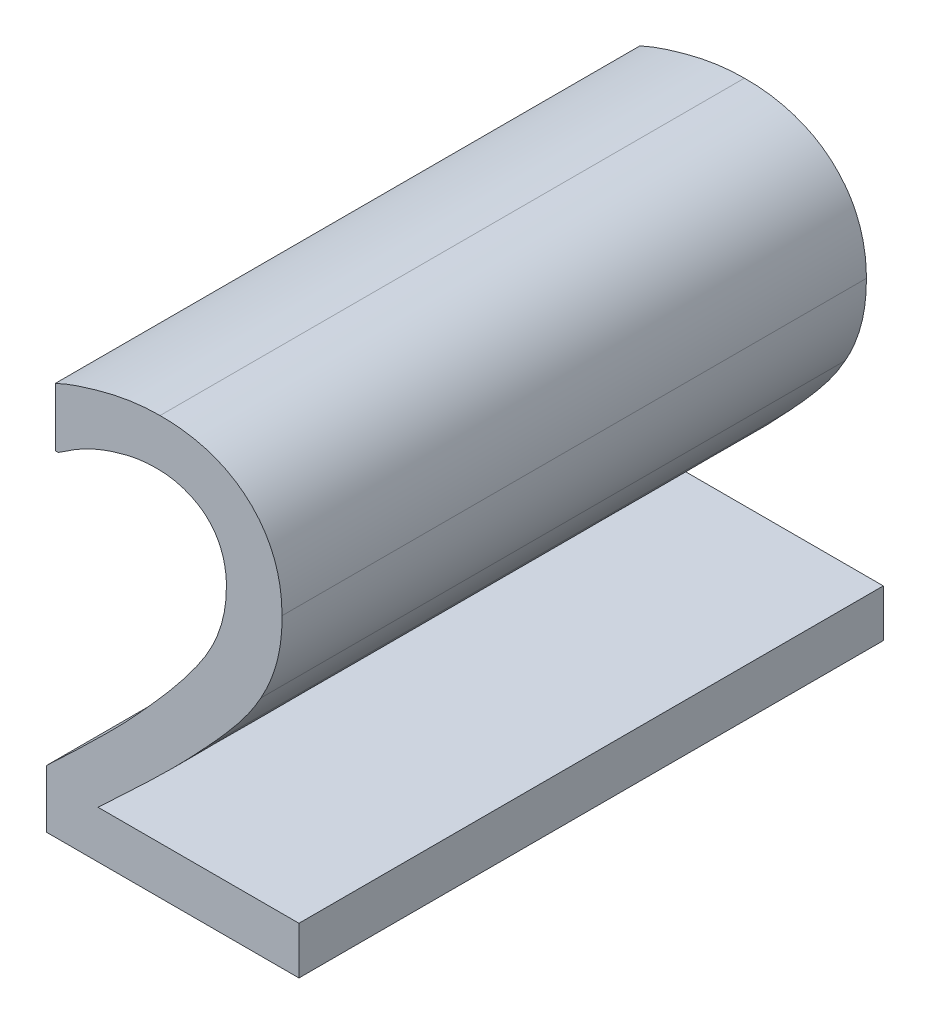
ISO-10303-21;
HEADER;
FILE_DESCRIPTION(('STEP AP214'),'2;1');
FILE_NAME('part.step','',(''),(''),'','','');
FILE_SCHEMA(('AUTOMOTIVE_DESIGN { 1 0 10303 214 1 1 1 1 }'));
ENDSEC;
DATA;
#1=APPLICATION_CONTEXT('core data for automotive mechanical design processes');
#2=APPLICATION_PROTOCOL_DEFINITION('international standard','automotive_design',2000,#1);
#3=PRODUCT_CONTEXT('',#1,'mechanical');
#4=PRODUCT('Part','Part','',(#3));
#5=PRODUCT_RELATED_PRODUCT_CATEGORY('part','',(#4));
#6=PRODUCT_DEFINITION_FORMATION('','',#4);
#7=PRODUCT_DEFINITION_CONTEXT('part definition',#1,'design');
#8=PRODUCT_DEFINITION('design','',#6,#7);
#9=PRODUCT_DEFINITION_SHAPE('','',#8);
#10=(LENGTH_UNIT() NAMED_UNIT(*) SI_UNIT(.MILLI.,.METRE.));
#11=(NAMED_UNIT(*) PLANE_ANGLE_UNIT() SI_UNIT($,.RADIAN.));
#12=(NAMED_UNIT(*) SI_UNIT($,.STERADIAN.) SOLID_ANGLE_UNIT());
#13=UNCERTAINTY_MEASURE_WITH_UNIT(LENGTH_MEASURE(1.E-05),#10,'distance_accuracy_value','');
#14=(GEOMETRIC_REPRESENTATION_CONTEXT(3) GLOBAL_UNCERTAINTY_ASSIGNED_CONTEXT((#13)) GLOBAL_UNIT_ASSIGNED_CONTEXT((#10,
#11,#12)) REPRESENTATION_CONTEXT('',''));
#15=CARTESIAN_POINT('',(0.,0.,0.));
#16=DIRECTION('',(0.,0.,1.));
#17=DIRECTION('',(1.,0.,0.));
#18=AXIS2_PLACEMENT_3D('',#15,#16,#17);
#19=CARTESIAN_POINT('',(0.625823054478695,-0.561987530902696,0.));
#20=DIRECTION('',(-1.,0.,0.));
#21=DIRECTION('',(0.,-1.,0.));
#22=AXIS2_PLACEMENT_3D('',#19,#20,#21);
#23=PLANE('',#22);
#24=DIRECTION('',(0.,1.,0.));
#25=VECTOR('',#24,1.);
#26=CARTESIAN_POINT('',(0.625823054478695,-0.571914597659679,0.));
#27=LINE('',#26,#25);
#28=CARTESIAN_POINT('',(0.625823054478695,-0.571914597659679,0.));
#29=VERTEX_POINT('',#28);
#30=CARTESIAN_POINT('',(0.625823054478695,-0.561987530902696,0.));
#31=VERTEX_POINT('',#30);
#32=EDGE_CURVE('E11',#29,#31,#27,.T.);
#33=ORIENTED_EDGE('',*,*,#32,.F.);
#34=DIRECTION('',(0.,0.,1.));
#35=VECTOR('',#34,1.);
#36=CARTESIAN_POINT('',(0.625823054478695,-0.571914597659679,0.));
#37=LINE('',#36,#35);
#38=CARTESIAN_POINT('',(0.625823054478695,-0.571914597659679,0.1));
#39=VERTEX_POINT('',#38);
#40=EDGE_CURVE('E351',#29,#39,#37,.T.);
#41=ORIENTED_EDGE('',*,*,#40,.T.);
#42=DIRECTION('',(0.,-1.,0.));
#43=VECTOR('',#42,1.);
#44=CARTESIAN_POINT('',(0.625823054478695,-0.561987530902696,0.1));
#45=LINE('',#44,#43);
#46=CARTESIAN_POINT('',(0.625823054478695,-0.561987530902696,0.1));
#47=VERTEX_POINT('',#46);
#48=EDGE_CURVE('E157',#47,#39,#45,.T.);
#49=ORIENTED_EDGE('',*,*,#48,.F.);
#50=DIRECTION('',(0.,0.,1.));
#51=VECTOR('',#50,1.);
#52=CARTESIAN_POINT('',(0.625823054478695,-0.561987530902696,0.));
#53=LINE('',#52,#51);
#54=EDGE_CURVE('E352',#31,#47,#53,.T.);
#55=ORIENTED_EDGE('',*,*,#54,.F.);
#56=EDGE_LOOP('',(#33,#41,#49,#55));
#57=FACE_BOUND('',#56,.T.);
#58=ADVANCED_FACE('F17',(#57),#23,.T.);
#59=CARTESIAN_POINT('',(0.642727431013443,-0.545139880463702,0.));
#60=CARTESIAN_POINT('',(0.642727431013443,-0.545139880463702,0.1));
#61=CARTESIAN_POINT('',(0.63875660431065,-0.549507789836774,0.));
#62=CARTESIAN_POINT('',(0.63875660431065,-0.549507789836774,0.1));
#63=CARTESIAN_POINT('',(0.630474594330538,-0.557619621529623,0.));
#64=CARTESIAN_POINT('',(0.630474594330538,-0.557619621529623,0.1));
#65=CARTESIAN_POINT('',(0.625823054478695,-0.561987530902696,0.));
#66=CARTESIAN_POINT('',(0.625823054478695,-0.561987530902696,0.1));
#67=B_SPLINE_SURFACE_WITH_KNOTS('',2,1,((#59,#60),(#61,#62),(#63,#64),(#65,#66)),.UNSPECIFIED.,
.F.,.F.,.F.,(3,1,3),(2,2),(0.,0.5,1.),(0.,1.),.UNSPECIFIED.);
#68=CARTESIAN_POINT('',(0.625823054478695,-0.561987530902696,0.));
#69=CARTESIAN_POINT('',(0.62874468107799,-0.55917190654432,0.));
#70=CARTESIAN_POINT('',(0.631717076489185,-0.556405094633854,0.));
#71=CARTESIAN_POINT('',(0.635030055396943,-0.553157419107484,0.));
#72=CARTESIAN_POINT('',(0.635443001068477,-0.552749607769018,0.));
#73=CARTESIAN_POINT('',(0.636293716162187,-0.55190173627245,0.));
#74=CARTESIAN_POINT('',(0.63673121589766,-0.551461404882065,0.));
#75=CARTESIAN_POINT('',(0.638041298998665,-0.550130571110377,0.));
#76=CARTESIAN_POINT('',(0.638907670100914,-0.5492339448571,0.));
#77=CARTESIAN_POINT('',(0.640764256127635,-0.547276807118519,0.));
#78=CARTESIAN_POINT('',(0.641751523915682,-0.546213498075349,0.));
#79=CARTESIAN_POINT('',(0.642727431050331,-0.545139880423125,0.));
#80=B_SPLINE_CURVE_WITH_KNOTS('',3,(#68,#69,#70,#71,#72,#73,#74,#75,#76,#77,#78,#79),
.UNSPECIFIED.,.F.,.F.,(4,2,2,2,2,4),(0.,0.0121766036694051,0.0139177205584076,
0.0157798614534191,0.0195200765979192,0.0238726498142932),.UNSPECIFIED.);
#81=CARTESIAN_POINT('',(0.642727431013443,-0.545139880463702,0.));
#82=VERTEX_POINT('',#81);
#83=EDGE_CURVE('E24',#31,#82,#80,.T.);
#84=CARTESIAN_POINT('',(0.642727431013443,-0.545139880463702,0.1));
#85=CARTESIAN_POINT('',(0.640139630647481,-0.548062208761181,0.1));
#86=CARTESIAN_POINT('',(0.637399464202121,-0.550835019502908,0.1));
#87=CARTESIAN_POINT('',(0.634198528478764,-0.553972509806504,0.1));
#88=CARTESIAN_POINT('',(0.633780476821556,-0.554380323541159,0.1));
#89=CARTESIAN_POINT('',(0.632908316234765,-0.55522854977929,0.1));
#90=CARTESIAN_POINT('',(0.632454100662797,-0.555668852074841,0.1));
#91=CARTESIAN_POINT('',(0.631067630207329,-0.557008142088938,0.1));
#92=CARTESIAN_POINT('',(0.630132912796379,-0.557904583348682,0.1));
#93=CARTESIAN_POINT('',(0.628075155748195,-0.559865325585857,0.1));
#94=CARTESIAN_POINT('',(0.626950879772611,-0.560928329933098,0.1));
#95=CARTESIAN_POINT('',(0.625823054478695,-0.561987530902696,0.1));
#96=B_SPLINE_CURVE_WITH_KNOTS('',3,(#84,#85,#86,#87,#88,#89,#90,#91,#92,#93,#94,#95),
.UNSPECIFIED.,.F.,.F.,(4,2,2,2,2,4),(0.,0.0116945562075137,0.0134466018522045,0.015344389911391,
0.0192296811545655,0.0238713644395515),.UNSPECIFIED.);
#97=CARTESIAN_POINT('',(0.642727431013443,-0.545139880463702,0.1));
#98=VERTEX_POINT('',#97);
#99=EDGE_CURVE('E361',#98,#47,#96,.T.);
#100=DIRECTION('',(0.,0.,1.));
#101=VECTOR('',#100,1.);
#102=CARTESIAN_POINT('',(0.642727431013443,-0.545139880463702,0.));
#103=LINE('',#102,#101);
#104=EDGE_CURVE('E365',#82,#98,#103,.T.);
#105=ORIENTED_EDGE('',*,*,#83,.F.);
#106=ORIENTED_EDGE('',*,*,#54,.T.);
#107=ORIENTED_EDGE('',*,*,#99,.F.);
#108=ORIENTED_EDGE('',*,*,#104,.F.);
#109=EDGE_LOOP('',(#105,#106,#107,#108));
#110=FACE_BOUND('',#109,.T.);
#111=ADVANCED_FACE('F266',(#110),#67,.T.);
#112=CARTESIAN_POINT('',(0.656568598377465,-0.520180398331859,0.));
#113=CARTESIAN_POINT('',(0.656568598377465,-0.520180398331859,0.1));
#114=CARTESIAN_POINT('',(0.656568598377465,-0.525796281811523,0.));
#115=CARTESIAN_POINT('',(0.656568598377465,-0.525796281811523,0.1));
#116=CARTESIAN_POINT('',(0.650725810514784,-0.536347335621803,0.));
#117=CARTESIAN_POINT('',(0.650725810514784,-0.536347335621803,0.1));
#118=CARTESIAN_POINT('',(0.642727431013443,-0.545139880463702,0.));
#119=CARTESIAN_POINT('',(0.642727431013443,-0.545139880463702,0.1));
#120=B_SPLINE_SURFACE_WITH_KNOTS('',2,1,((#112,#113),(#114,#115),(#116,#117),(#118,#119)),
.UNSPECIFIED.,.F.,.F.,.F.,(3,1,3),(2,2),(0.,0.5,1.),(0.,1.),.UNSPECIFIED.);
#121=CARTESIAN_POINT('',(0.642727431013443,-0.545139880463702,0.));
#122=CARTESIAN_POINT('',(0.644053076193031,-0.543676533635371,0.));
#123=CARTESIAN_POINT('',(0.64536302671812,-0.542200049203178,0.));
#124=CARTESIAN_POINT('',(0.647925030110276,-0.539173245774515,0.));
#125=CARTESIAN_POINT('',(0.649176388739026,-0.53762234444595,0.));
#126=CARTESIAN_POINT('',(0.651570812024535,-0.534421648737832,0.));
#127=CARTESIAN_POINT('',(0.652713531732365,-0.532771564840158,0.));
#128=CARTESIAN_POINT('',(0.653876643328962,-0.530654459686083,0.));
#129=CARTESIAN_POINT('',(0.654069380708433,-0.530284973397732,0.));
#130=CARTESIAN_POINT('',(0.654458361816529,-0.529491190910448,0.));
#131=CARTESIAN_POINT('',(0.654652167048748,-0.529065705361805,0.));
#132=CARTESIAN_POINT('',(0.655186861277434,-0.527793352123892,0.));
#133=CARTESIAN_POINT('',(0.655492034506122,-0.526931110910611,0.));
#134=CARTESIAN_POINT('',(0.65628839365389,-0.524151288703909,0.));
#135=CARTESIAN_POINT('',(0.656581271265802,-0.522175990312261,0.));
#136=CARTESIAN_POINT('',(0.656568598377465,-0.520180398314576,0.));
#137=B_SPLINE_CURVE_WITH_KNOTS('',3,(#121,#122,#123,#124,#125,#126,#127,#128,#129,#130,#131,
#132,#133,#134,#135,#136),.UNSPECIFIED.,.F.,.F.,(4,2,2,2,2,2,2,4),(0.,0.00592083735917879,
0.0118997721387433,0.0178970979462094,0.0191467125768363,0.0205487103418422,0.0232859976376046,
0.0292165184775066),.UNSPECIFIED.);
#138=CARTESIAN_POINT('',(0.656568598377465,-0.520180398331859,0.));
#139=VERTEX_POINT('',#138);
#140=EDGE_CURVE('E343',#82,#139,#137,.T.);
#141=CARTESIAN_POINT('',(0.656568598377465,-0.520180398331859,0.1));
#142=CARTESIAN_POINT('',(0.656592536878072,-0.522377012249024,0.1));
#143=CARTESIAN_POINT('',(0.656232444743381,-0.524540135297152,0.1));
#144=CARTESIAN_POINT('',(0.655073945588548,-0.528196073751852,0.1));
#145=CARTESIAN_POINT('',(0.654398140021289,-0.529727117087454,0.1));
#146=CARTESIAN_POINT('',(0.653293379127338,-0.531705845659908,0.1));
#147=CARTESIAN_POINT('',(0.652980714583511,-0.532223348837367,0.1));
#148=CARTESIAN_POINT('',(0.652237247862593,-0.533393616463556,0.1));
#149=CARTESIAN_POINT('',(0.651798706839521,-0.534041498831357,0.1));
#150=CARTESIAN_POINT('',(0.650274951951803,-0.536202450706516,0.1));
#151=CARTESIAN_POINT('',(0.649133121732926,-0.537674612249056,0.1));
#152=CARTESIAN_POINT('',(0.646263883950751,-0.541170982503649,0.1));
#153=CARTESIAN_POINT('',(0.644494853285861,-0.543162082072496,0.1));
#154=CARTESIAN_POINT('',(0.642727431013443,-0.545139880463702,0.1));
#155=B_SPLINE_CURVE_WITH_KNOTS('',3,(#141,#142,#143,#144,#145,#146,#147,#148,#149,#150,#151,
#152,#153,#154),.UNSPECIFIED.,.F.,.F.,(4,2,2,2,2,2,4),(0.,0.00650665118596856,
0.0114873313360082,0.013300893256136,0.0156467611691324,0.0212325655912729,0.0292067960251315),.UNSPECIFIED.);
#156=CARTESIAN_POINT('',(0.656568598377465,-0.520180398331859,0.1));
#157=VERTEX_POINT('',#156);
#158=EDGE_CURVE('E364',#157,#98,#155,.T.);
#159=DIRECTION('',(0.,0.,1.));
#160=VECTOR('',#159,1.);
#161=CARTESIAN_POINT('',(0.656568598377465,-0.520180398331859,0.));
#162=LINE('',#161,#160);
#163=EDGE_CURVE('E367',#139,#157,#162,.T.);
#164=ORIENTED_EDGE('',*,*,#140,.F.);
#165=ORIENTED_EDGE('',*,*,#104,.T.);
#166=ORIENTED_EDGE('',*,*,#158,.F.);
#167=ORIENTED_EDGE('',*,*,#163,.F.);
#168=EDGE_LOOP('',(#164,#165,#166,#167));
#169=FACE_BOUND('',#168,.T.);
#170=ADVANCED_FACE('F261',(#169),#120,.T.);
#171=CARTESIAN_POINT('',(0.653108306536459,-0.51138785348996,0.));
#172=CARTESIAN_POINT('',(0.653108306536459,-0.51138785348996,0.1));
#173=CARTESIAN_POINT('',(0.654753363313331,-0.512806005883814,0.));
#174=CARTESIAN_POINT('',(0.654753363313331,-0.512806005883814,0.1));
#175=CARTESIAN_POINT('',(0.656568598377465,-0.517230641352641,0.));
#176=CARTESIAN_POINT('',(0.656568598377465,-0.517230641352641,0.1));
#177=CARTESIAN_POINT('',(0.656568598377465,-0.520180398331859,0.));
#178=CARTESIAN_POINT('',(0.656568598377465,-0.520180398331859,0.1));
#179=B_SPLINE_SURFACE_WITH_KNOTS('',2,1,((#171,#172),(#173,#174),(#175,#176),(#177,#178)),
.UNSPECIFIED.,.F.,.F.,.F.,(3,1,3),(2,2),(0.,0.5,1.),(0.,1.),.UNSPECIFIED.);
#180=CARTESIAN_POINT('',(0.656568598377465,-0.520180398331859,0.));
#181=CARTESIAN_POINT('',(0.656598596253882,-0.518822255746775,0.));
#182=CARTESIAN_POINT('',(0.656429958288455,-0.517419398683534,0.));
#183=CARTESIAN_POINT('',(0.655744221812142,-0.515112091915538,0.));
#184=CARTESIAN_POINT('',(0.655330658264385,-0.514173719082865,0.));
#185=CARTESIAN_POINT('',(0.654322157261044,-0.512606249680711,0.));
#186=CARTESIAN_POINT('',(0.653766014609882,-0.511951720961795,0.));
#187=CARTESIAN_POINT('',(0.653108302961449,-0.511387850408055,0.));
#188=B_SPLINE_CURVE_WITH_KNOTS('',3,(#180,#181,#182,#183,#184,#185,#186,#187),.UNSPECIFIED.,.F.,
.F.,(4,2,2,4),(0.,0.00412437798620304,0.00716191922484357,0.00972134548947091),.UNSPECIFIED.);
#189=CARTESIAN_POINT('',(0.653108306536459,-0.51138785348996,0.));
#190=VERTEX_POINT('',#189);
#191=EDGE_CURVE('E335',#139,#190,#188,.T.);
#192=CARTESIAN_POINT('',(0.653108306536459,-0.51138785348996,0.1));
#193=CARTESIAN_POINT('',(0.653795364262431,-0.511977197403441,0.1));
#194=CARTESIAN_POINT('',(0.654371271241597,-0.512664628218596,0.1));
#195=CARTESIAN_POINT('',(0.655367762837962,-0.514253729361756,0.1));
#196=CARTESIAN_POINT('',(0.655764639574328,-0.515170569578763,0.1));
#197=CARTESIAN_POINT('',(0.656432242180452,-0.517443144165376,0.1));
#198=CARTESIAN_POINT('',(0.656597437121624,-0.518833094703271,0.1));
#199=CARTESIAN_POINT('',(0.656568598377465,-0.520180398331859,0.1));
#200=B_SPLINE_CURVE_WITH_KNOTS('',3,(#192,#193,#194,#195,#196,#197,#198,#199),.UNSPECIFIED.,.F.,
.F.,(4,2,2,4),(0.,0.00267100911726054,0.00563254353652329,0.00972143011809582),.UNSPECIFIED.);
#201=CARTESIAN_POINT('',(0.653108306536459,-0.51138785348996,0.1));
#202=VERTEX_POINT('',#201);
#203=EDGE_CURVE('E382',#202,#157,#200,.T.);
#204=DIRECTION('',(0.,0.,1.));
#205=VECTOR('',#204,1.);
#206=CARTESIAN_POINT('',(0.653108306536459,-0.51138785348996,0.));
#207=LINE('',#206,#205);
#208=EDGE_CURVE('E380',#190,#202,#207,.T.);
#209=ORIENTED_EDGE('',*,*,#191,.F.);
#210=ORIENTED_EDGE('',*,*,#163,.T.);
#211=ORIENTED_EDGE('',*,*,#203,.F.);
#212=ORIENTED_EDGE('',*,*,#208,.F.);
#213=EDGE_LOOP('',(#209,#210,#211,#212));
#214=FACE_BOUND('',#213,.T.);
#215=ADVANCED_FACE('F390',(#214),#179,.T.);
#216=CARTESIAN_POINT('',(0.644542666077577,-0.50855154870225,0.));
#217=CARTESIAN_POINT('',(0.644542666077577,-0.50855154870225,0.1));
#218=CARTESIAN_POINT('',(0.64715206648227,-0.50855154870225,0.));
#219=CARTESIAN_POINT('',(0.64715206648227,-0.50855154870225,0.1));
#220=CARTESIAN_POINT('',(0.651463249759588,-0.509969701096105,0.));
#221=CARTESIAN_POINT('',(0.651463249759588,-0.509969701096105,0.1));
#222=CARTESIAN_POINT('',(0.653108306536459,-0.51138785348996,0.));
#223=CARTESIAN_POINT('',(0.653108306536459,-0.51138785348996,0.1));
#224=B_SPLINE_SURFACE_WITH_KNOTS('',2,1,((#216,#217),(#218,#219),(#220,#221),(#222,#223)),
.UNSPECIFIED.,.F.,.F.,.F.,(3,1,3),(2,2),(0.,0.5,1.),(0.,1.),.UNSPECIFIED.);
#225=CARTESIAN_POINT('',(0.653108306536459,-0.51138785348996,0.));
#226=CARTESIAN_POINT('',(0.652274029533856,-0.510654199528889,0.));
#227=CARTESIAN_POINT('',(0.6513333840342,-0.510081761562588,0.));
#228=CARTESIAN_POINT('',(0.649197860773459,-0.509161177782728,0.));
#229=CARTESIAN_POINT('',(0.647985841722776,-0.508851447241249,0.));
#230=CARTESIAN_POINT('',(0.646020506909166,-0.508592586748,0.));
#231=CARTESIAN_POINT('',(0.645277735772408,-0.508548750750198,0.));
#232=CARTESIAN_POINT('',(0.644542665359295,-0.50855154870225,0.));
#233=B_SPLINE_CURVE_WITH_KNOTS('',3,(#225,#226,#227,#228,#229,#230,#231,#232),.UNSPECIFIED.,.F.,
.F.,(4,2,2,4),(0.,0.00327718880556356,0.00697674411635474,0.00919573260062213),.UNSPECIFIED.);
#234=CARTESIAN_POINT('',(0.644542666077577,-0.50855154870225,0.));
#235=VERTEX_POINT('',#234);
#236=EDGE_CURVE('E327',#190,#235,#233,.T.);
#237=CARTESIAN_POINT('',(0.644542666077577,-0.50855154870225,0.1));
#238=CARTESIAN_POINT('',(0.646041815335929,-0.50852278368446,0.1));
#239=CARTESIAN_POINT('',(0.64758724917215,-0.508723611476948,0.1));
#240=CARTESIAN_POINT('',(0.650163467965971,-0.50952550005134,0.1));
#241=CARTESIAN_POINT('',(0.651229871264231,-0.510021467827317,0.1));
#242=CARTESIAN_POINT('',(0.652506952187631,-0.510895682706202,0.1));
#243=CARTESIAN_POINT('',(0.652814867366866,-0.511132663421017,0.1));
#244=CARTESIAN_POINT('',(0.653108306539144,-0.511387853492275,0.1));
#245=B_SPLINE_CURVE_WITH_KNOTS('',3,(#237,#238,#239,#240,#241,#242,#243,#244),.UNSPECIFIED.,.F.,
.F.,(4,2,2,4),(0.,0.00454745343299242,0.00802673764956078,0.00919087766314994),.UNSPECIFIED.);
#246=CARTESIAN_POINT('',(0.644542666077577,-0.50855154870225,0.1));
#247=VERTEX_POINT('',#246);
#248=EDGE_CURVE('E419',#247,#202,#245,.T.);
#249=DIRECTION('',(0.,0.,1.));
#250=VECTOR('',#249,1.);
#251=CARTESIAN_POINT('',(0.644542666077577,-0.50855154870225,0.));
#252=LINE('',#251,#250);
#253=EDGE_CURVE('E424',#235,#247,#252,.T.);
#254=ORIENTED_EDGE('',*,*,#236,.F.);
#255=ORIENTED_EDGE('',*,*,#208,.T.);
#256=ORIENTED_EDGE('',*,*,#248,.F.);
#257=ORIENTED_EDGE('',*,*,#253,.F.);
#258=EDGE_LOOP('',(#254,#255,#256,#257));
#259=FACE_BOUND('',#258,.T.);
#260=ADVANCED_FACE('F395',(#259),#224,.T.);
#261=CARTESIAN_POINT('',(0.634615599320594,-0.510763866436664,0.));
#262=CARTESIAN_POINT('',(0.634615599320594,-0.510763866436664,0.1));
#263=CARTESIAN_POINT('',(0.636941369246516,-0.509799522808842,0.));
#264=CARTESIAN_POINT('',(0.636941369246516,-0.509799522808842,0.1));
#265=CARTESIAN_POINT('',(0.642046717864393,-0.50855154870225,0.));
#266=CARTESIAN_POINT('',(0.642046717864393,-0.50855154870225,0.1));
#267=CARTESIAN_POINT('',(0.644542666077577,-0.50855154870225,0.));
#268=CARTESIAN_POINT('',(0.644542666077577,-0.50855154870225,0.1));
#269=B_SPLINE_SURFACE_WITH_KNOTS('',2,1,((#261,#262),(#263,#264),(#265,#266),(#267,#268)),
.UNSPECIFIED.,.F.,.F.,.F.,(3,1,3),(2,2),(0.,0.5,1.),(0.,1.),.UNSPECIFIED.);
#270=CARTESIAN_POINT('',(0.644542666077577,-0.50855154870225,0.));
#271=CARTESIAN_POINT('',(0.643686917568463,-0.508545347555565,0.));
#272=CARTESIAN_POINT('',(0.642834321006452,-0.508603696123068,0.));
#273=CARTESIAN_POINT('',(0.641149465743223,-0.508821493658442,0.));
#274=CARTESIAN_POINT('',(0.640317092793555,-0.508980022459483,0.));
#275=CARTESIAN_POINT('',(0.638664891578705,-0.509372498741971,0.));
#276=CARTESIAN_POINT('',(0.637845202092891,-0.509606996721446,0.));
#277=CARTESIAN_POINT('',(0.636218464102614,-0.510140324237424,0.));
#278=CARTESIAN_POINT('',(0.63541160225055,-0.510439727888596,0.));
#279=CARTESIAN_POINT('',(0.634615599320594,-0.510763866436664,0.));
#280=B_SPLINE_CURVE_WITH_KNOTS('',3,(#270,#271,#272,#273,#274,#275,#276,#277,#278,#279),
.UNSPECIFIED.,.F.,.F.,(4,2,2,2,4),(0.,0.00255970627533919,0.00509623645174878,
0.00765157447102962,0.0102305115459305),.UNSPECIFIED.);
#281=CARTESIAN_POINT('',(0.634615599320594,-0.510763866436664,0.));
#282=VERTEX_POINT('',#281);
#283=EDGE_CURVE('E317',#235,#282,#280,.T.);
#284=CARTESIAN_POINT('',(0.634615599320594,-0.510763866436664,0.1));
#285=CARTESIAN_POINT('',(0.635411602250546,-0.510439727888595,0.1));
#286=CARTESIAN_POINT('',(0.636218464102608,-0.510140324237425,0.1));
#287=CARTESIAN_POINT('',(0.637845202092886,-0.509606996721449,0.1));
#288=CARTESIAN_POINT('',(0.638664891578703,-0.509372498741975,0.1));
#289=CARTESIAN_POINT('',(0.640317092792721,-0.508980022459679,0.1));
#290=CARTESIAN_POINT('',(0.641149465741534,-0.508821493658753,0.1));
#291=CARTESIAN_POINT('',(0.642834321003016,-0.508603696123401,0.1));
#292=CARTESIAN_POINT('',(0.643686917564137,-0.5085453475558,0.1));
#293=CARTESIAN_POINT('',(0.644542666072367,-0.50855154870225,0.1));
#294=B_SPLINE_CURVE_WITH_KNOTS('',3,(#284,#285,#286,#287,#288,#289,#290,#291,#292,#293),
.UNSPECIFIED.,.F.,.F.,(4,2,2,2,4),(0.,0.00257893707489138,0.00513427509418167,
0.00767080526802396,0.0102305115407302),.UNSPECIFIED.);
#295=CARTESIAN_POINT('',(0.634615599320594,-0.510763866436664,0.1));
#296=VERTEX_POINT('',#295);
#297=EDGE_CURVE('E422',#296,#247,#294,.T.);
#298=DIRECTION('',(0.,0.,1.));
#299=VECTOR('',#298,1.);
#300=CARTESIAN_POINT('',(0.634615599320594,-0.510763866436664,0.));
#301=LINE('',#300,#299);
#302=EDGE_CURVE('E428',#282,#296,#301,.T.);
#303=ORIENTED_EDGE('',*,*,#283,.F.);
#304=ORIENTED_EDGE('',*,*,#253,.T.);
#305=ORIENTED_EDGE('',*,*,#297,.F.);
#306=ORIENTED_EDGE('',*,*,#302,.F.);
#307=EDGE_LOOP('',(#303,#304,#305,#306));
#308=FACE_BOUND('',#307,.T.);
#309=ADVANCED_FACE('F439',(#308),#269,.T.);
#310=CARTESIAN_POINT('',(0.627808467830091,-0.514621240947948,0.));
#311=CARTESIAN_POINT('',(0.627808467830091,-0.514621240947948,0.1));
#312=CARTESIAN_POINT('',(0.628942989745175,-0.51382707560739,0.));
#313=CARTESIAN_POINT('',(0.628942989745175,-0.51382707560739,0.1));
#314=CARTESIAN_POINT('',(0.632630185969197,-0.511558031777222,0.));
#315=CARTESIAN_POINT('',(0.632630185969197,-0.511558031777222,0.1));
#316=CARTESIAN_POINT('',(0.634615599320594,-0.510763866436664,0.));
#317=CARTESIAN_POINT('',(0.634615599320594,-0.510763866436664,0.1));
#318=B_SPLINE_SURFACE_WITH_KNOTS('',2,1,((#310,#311),(#312,#313),(#314,#315),(#316,#317)),
.UNSPECIFIED.,.F.,.F.,.F.,(3,1,3),(2,2),(0.,0.5,1.),(0.,1.),.UNSPECIFIED.);
#319=CARTESIAN_POINT('',(0.634615599320594,-0.510763866436664,0.));
#320=CARTESIAN_POINT('',(0.633261357063377,-0.51126516772344,0.));
#321=CARTESIAN_POINT('',(0.632007085601711,-0.511949656539129,0.));
#322=CARTESIAN_POINT('',(0.630425911648797,-0.512912091442426,0.));
#323=CARTESIAN_POINT('',(0.630068184918741,-0.513136729939855,0.));
#324=CARTESIAN_POINT('',(0.629388020549716,-0.513568921794931,0.));
#325=CARTESIAN_POINT('',(0.629065364992749,-0.513776144946892,0.));
#326=CARTESIAN_POINT('',(0.628430152745438,-0.514194264618407,0.));
#327=CARTESIAN_POINT('',(0.628117517380832,-0.514405042135403,0.));
#328=CARTESIAN_POINT('',(0.627808467831499,-0.514621240946963,0.));
#329=B_SPLINE_CURVE_WITH_KNOTS('',3,(#319,#320,#321,#322,#323,#324,#325,#326,#327,#328),
.UNSPECIFIED.,.F.,.F.,(4,2,2,2,4),(0.,0.00428732594090233,0.00555429775329131,
0.00670467168244871,0.00783584904493266),.UNSPECIFIED.);
#330=CARTESIAN_POINT('',(0.627808467830091,-0.514621240947948,0.));
#331=VERTEX_POINT('',#330);
#332=EDGE_CURVE('E307',#282,#331,#329,.T.);
#333=CARTESIAN_POINT('',(0.627808467830091,-0.514621240947948,0.1));
#334=CARTESIAN_POINT('',(0.628280575519196,-0.514298398797895,0.1));
#335=CARTESIAN_POINT('',(0.628755761127737,-0.513979887178841,0.1));
#336=CARTESIAN_POINT('',(0.62975911969801,-0.513326593784717,0.1));
#337=CARTESIAN_POINT('',(0.630288104101228,-0.512993061577079,0.1));
#338=CARTESIAN_POINT('',(0.631192724936132,-0.512447007068512,0.1));
#339=CARTESIAN_POINT('',(0.631565013467083,-0.512229048891497,0.1));
#340=CARTESIAN_POINT('',(0.632344488140216,-0.511802064786014,0.1));
#341=CARTESIAN_POINT('',(0.632752419543874,-0.511594388663626,0.1));
#342=CARTESIAN_POINT('',(0.633642447330083,-0.511171871837105,0.1));
#343=CARTESIAN_POINT('',(0.63412634135764,-0.510960796810176,0.1));
#344=CARTESIAN_POINT('',(0.634615599320594,-0.510763866436664,0.1));
#345=B_SPLINE_CURVE_WITH_KNOTS('',3,(#333,#334,#335,#336,#337,#338,#339,#340,#341,#342,#343,
#344),.UNSPECIFIED.,.F.,.F.,(4,2,2,2,2,4),(0.,0.00171592048433093,0.00359173599418033,
0.00488550807886556,0.00625797846467483,0.00784044577355749),.UNSPECIFIED.);
#346=CARTESIAN_POINT('',(0.627808467830091,-0.514621240947948,0.1));
#347=VERTEX_POINT('',#346);
#348=EDGE_CURVE('E474',#347,#296,#345,.T.);
#349=DIRECTION('',(0.,0.,1.));
#350=VECTOR('',#349,1.);
#351=CARTESIAN_POINT('',(0.627808467830091,-0.514621240947948,0.));
#352=LINE('',#351,#350);
#353=EDGE_CURVE('E479',#331,#347,#352,.T.);
#354=ORIENTED_EDGE('',*,*,#332,.F.);
#355=ORIENTED_EDGE('',*,*,#302,.T.);
#356=ORIENTED_EDGE('',*,*,#348,.F.);
#357=ORIENTED_EDGE('',*,*,#353,.F.);
#358=EDGE_LOOP('',(#354,#355,#356,#357));
#359=FACE_BOUND('',#358,.T.);
#360=ADVANCED_FACE('F450',(#359),#318,.T.);
#361=CARTESIAN_POINT('',(0.627297932968304,-0.514621240947948,0.));
#362=DIRECTION('',(0.,-1.,0.));
#363=DIRECTION('',(1.,0.,0.));
#364=AXIS2_PLACEMENT_3D('',#361,#362,#363);
#365=PLANE('',#364);
#366=DIRECTION('',(-1.,0.,0.));
#367=VECTOR('',#366,1.);
#368=CARTESIAN_POINT('',(0.627808467830091,-0.514621240947948,0.));
#369=LINE('',#368,#367);
#370=CARTESIAN_POINT('',(0.627297932968304,-0.514621240947948,0.));
#371=VERTEX_POINT('',#370);
#372=EDGE_CURVE('E425',#331,#371,#369,.T.);
#373=ORIENTED_EDGE('',*,*,#372,.F.);
#374=ORIENTED_EDGE('',*,*,#353,.T.);
#375=DIRECTION('',(1.,-2.17462725412893E-13,0.));
#376=VECTOR('',#375,1.);
#377=CARTESIAN_POINT('',(0.627297932968304,-0.514621240947948,0.1));
#378=LINE('',#377,#376);
#379=CARTESIAN_POINT('',(0.627297932968304,-0.514621240947948,0.1));
#380=VERTEX_POINT('',#379);
#381=EDGE_CURVE('E478',#380,#347,#378,.T.);
#382=ORIENTED_EDGE('',*,*,#381,.F.);
#383=DIRECTION('',(0.,0.,1.));
#384=VECTOR('',#383,1.);
#385=CARTESIAN_POINT('',(0.627297932968304,-0.514621240947948,0.));
#386=LINE('',#385,#384);
#387=EDGE_CURVE('E481',#371,#380,#386,.T.);
#388=ORIENTED_EDGE('',*,*,#387,.F.);
#389=EDGE_LOOP('',(#373,#374,#382,#388));
#390=FACE_BOUND('',#389,.T.);
#391=ADVANCED_FACE('F500',(#390),#365,.T.);
#392=CARTESIAN_POINT('',(0.627297932968304,-0.504637448095211,0.));
#393=DIRECTION('',(-1.,0.,0.));
#394=DIRECTION('',(0.,-1.,0.));
#395=AXIS2_PLACEMENT_3D('',#392,#393,#394);
#396=PLANE('',#395);
#397=DIRECTION('',(0.,1.,0.));
#398=VECTOR('',#397,1.);
#399=CARTESIAN_POINT('',(0.627297932968304,-0.514621240947948,0.));
#400=LINE('',#399,#398);
#401=CARTESIAN_POINT('',(0.627297932968304,-0.504637448095211,0.));
#402=VERTEX_POINT('',#401);
#403=EDGE_CURVE('E468',#371,#402,#400,.T.);
#404=ORIENTED_EDGE('',*,*,#403,.F.);
#405=ORIENTED_EDGE('',*,*,#387,.T.);
#406=DIRECTION('',(0.,-1.,0.));
#407=VECTOR('',#406,1.);
#408=CARTESIAN_POINT('',(0.627297932968304,-0.504637448095211,0.1));
#409=LINE('',#408,#407);
#410=CARTESIAN_POINT('',(0.627297932968304,-0.504637448095211,0.1));
#411=VERTEX_POINT('',#410);
#412=EDGE_CURVE('E252',#411,#380,#409,.T.);
#413=ORIENTED_EDGE('',*,*,#412,.F.);
#414=DIRECTION('',(0.,0.,1.));
#415=VECTOR('',#414,1.);
#416=CARTESIAN_POINT('',(0.627297932968304,-0.504637448095211,0.));
#417=LINE('',#416,#415);
#418=EDGE_CURVE('E491',#402,#411,#417,.T.);
#419=ORIENTED_EDGE('',*,*,#418,.F.);
#420=EDGE_LOOP('',(#404,#405,#413,#419));
#421=FACE_BOUND('',#420,.T.);
#422=ADVANCED_FACE('F498',(#421),#396,.T.);
#423=CARTESIAN_POINT('',(0.645223379226627,-0.500439717009401,0.));
#424=CARTESIAN_POINT('',(0.645223379226627,-0.500439717009401,0.1));
#425=CARTESIAN_POINT('',(0.640571839374784,-0.500439717009401,0.));
#426=CARTESIAN_POINT('',(0.640571839374784,-0.500439717009401,0.1));
#427=CARTESIAN_POINT('',(0.630190963851767,-0.503219295701357,0.));
#428=CARTESIAN_POINT('',(0.630190963851767,-0.503219295701357,0.1));
#429=CARTESIAN_POINT('',(0.627297932968304,-0.504637448095211,0.));
#430=CARTESIAN_POINT('',(0.627297932968304,-0.504637448095211,0.1));
#431=B_SPLINE_SURFACE_WITH_KNOTS('',2,1,((#423,#424),(#425,#426),(#427,#428),(#429,#430)),
.UNSPECIFIED.,.F.,.F.,.F.,(3,1,3),(2,2),(0.,0.5,1.),(0.,1.),.UNSPECIFIED.);
#432=CARTESIAN_POINT('',(0.627297932968304,-0.504637448095211,0.));
#433=CARTESIAN_POINT('',(0.628252259670292,-0.504185517917475,0.));
#434=CARTESIAN_POINT('',(0.629227089793208,-0.503784265499205,0.));
#435=CARTESIAN_POINT('',(0.631839548962886,-0.502825064225851,0.));
#436=CARTESIAN_POINT('',(0.633501222214257,-0.502331704906204,0.));
#437=CARTESIAN_POINT('',(0.63575571469945,-0.50173006370928,0.));
#438=CARTESIAN_POINT('',(0.636339471819437,-0.501580339463479,0.));
#439=CARTESIAN_POINT('',(0.637464346537139,-0.501318735083703,0.));
#440=CARTESIAN_POINT('',(0.638004955566667,-0.501204739146458,0.));
#441=CARTESIAN_POINT('',(0.63959405503076,-0.500902151894958,0.));
#442=CARTESIAN_POINT('',(0.640648306387013,-0.500742504555591,0.));
#443=CARTESIAN_POINT('',(0.642874803219566,-0.500505960659923,0.));
#444=CARTESIAN_POINT('',(0.644048102206703,-0.500439181621366,0.));
#445=CARTESIAN_POINT('',(0.645223379226627,-0.500439717009401,0.));
#446=B_SPLINE_CURVE_WITH_KNOTS('',3,(#432,#433,#434,#435,#436,#437,#438,#439,#440,#441,#442,
#443,#444,#445),.UNSPECIFIED.,.F.,.F.,(4,2,2,2,2,2,4),(0.,0.00316151587141028,
0.00835102058706371,0.0101589971406701,0.011816044984201,0.01501079702631,0.0185318560347144),.UNSPECIFIED.);
#447=CARTESIAN_POINT('',(0.645223379226627,-0.500439717009401,0.));
#448=VERTEX_POINT('',#447);
#449=EDGE_CURVE('E298',#402,#448,#446,.T.);
#450=CARTESIAN_POINT('',(0.645223379226627,-0.500439717009401,0.1));
#451=CARTESIAN_POINT('',(0.643650218371998,-0.50044030059092,0.1));
#452=CARTESIAN_POINT('',(0.642081865145191,-0.500558958649346,0.1));
#453=CARTESIAN_POINT('',(0.638981700098205,-0.50098887760499,0.1));
#454=CARTESIAN_POINT('',(0.637449713592609,-0.501298839461806,0.1));
#455=CARTESIAN_POINT('',(0.635513064061854,-0.501792359836881,0.1));
#456=CARTESIAN_POINT('',(0.635089115535893,-0.501906777133225,0.1));
#457=CARTESIAN_POINT('',(0.633902194476829,-0.502236213615044,0.1));
#458=CARTESIAN_POINT('',(0.633141098016551,-0.502458057168381,0.1));
#459=CARTESIAN_POINT('',(0.631499247723359,-0.502969586398249,0.1));
#460=CARTESIAN_POINT('',(0.630619999560797,-0.503264401833233,0.1));
#461=CARTESIAN_POINT('',(0.62892123942179,-0.503906298922985,0.1));
#462=CARTESIAN_POINT('',(0.628100744660351,-0.504250819188148,0.1));
#463=CARTESIAN_POINT('',(0.627297932968304,-0.504637448095211,0.1));
#464=B_SPLINE_CURVE_WITH_KNOTS('',3,(#450,#451,#452,#453,#454,#455,#456,#457,#458,#459,#460,
#461,#462,#463),.UNSPECIFIED.,.F.,.F.,(4,2,2,2,2,2,4),(0.,0.00470874644985221,
0.00938586489214669,0.0107032565631838,0.0130813829971799,0.0158612414539019,
0.0185299408991342),.UNSPECIFIED.);
#465=CARTESIAN_POINT('',(0.645223379226627,-0.500439717009401,0.1));
#466=VERTEX_POINT('',#465);
#467=EDGE_CURVE('E497',#466,#411,#464,.T.);
#468=DIRECTION('',(0.,0.,1.));
#469=VECTOR('',#468,1.);
#470=CARTESIAN_POINT('',(0.645223379226627,-0.500439717009401,0.));
#471=LINE('',#470,#469);
#472=EDGE_CURVE('E253',#448,#466,#471,.T.);
#473=ORIENTED_EDGE('',*,*,#449,.F.);
#474=ORIENTED_EDGE('',*,*,#418,.T.);
#475=ORIENTED_EDGE('',*,*,#467,.F.);
#476=ORIENTED_EDGE('',*,*,#472,.F.);
#477=EDGE_LOOP('',(#473,#474,#475,#476));
#478=FACE_BOUND('',#477,.T.);
#479=ADVANCED_FACE('F506',(#478),#431,.T.);
#480=CARTESIAN_POINT('',(0.666098582464169,-0.519669863470071,0.));
#481=CARTESIAN_POINT('',(0.666098582464169,-0.519669863470071,0.1));
#482=CARTESIAN_POINT('',(0.666098582464169,-0.510820592532418,0.));
#483=CARTESIAN_POINT('',(0.666098582464169,-0.510820592532418,0.1));
#484=CARTESIAN_POINT('',(0.655036993792102,-0.500439717009401,0.));
#485=CARTESIAN_POINT('',(0.655036993792102,-0.500439717009401,0.1));
#486=CARTESIAN_POINT('',(0.645223379226627,-0.500439717009401,0.));
#487=CARTESIAN_POINT('',(0.645223379226627,-0.500439717009401,0.1));
#488=B_SPLINE_SURFACE_WITH_KNOTS('',2,1,((#480,#481),(#482,#483),(#484,#485),(#486,#487)),
.UNSPECIFIED.,.F.,.F.,.F.,(3,1,3),(2,2),(0.,0.5,1.),(0.,1.),.UNSPECIFIED.);
#489=CARTESIAN_POINT('',(0.645223379226627,-0.500439717009401,0.));
#490=CARTESIAN_POINT('',(0.647846651933097,-0.500397798399018,0.));
#491=CARTESIAN_POINT('',(0.650574182204322,-0.500710064715241,0.));
#492=CARTESIAN_POINT('',(0.655048232134539,-0.502046464478418,0.));
#493=CARTESIAN_POINT('',(0.656864388201028,-0.502862342056251,0.));
#494=CARTESIAN_POINT('',(0.659940902251095,-0.504949302088161,0.));
#495=CARTESIAN_POINT('',(0.661240792453657,-0.506158888549942,0.));
#496=CARTESIAN_POINT('',(0.663371444402232,-0.508887088800989,0.));
#497=CARTESIAN_POINT('',(0.664212846895513,-0.510397471276909,0.));
#498=CARTESIAN_POINT('',(0.665474006668236,-0.513738767027488,0.));
#499=CARTESIAN_POINT('',(0.665847422928946,-0.515586416039221,0.));
#500=CARTESIAN_POINT('',(0.666069747440815,-0.518186902531669,0.));
#501=CARTESIAN_POINT('',(0.666099001843425,-0.518930421007781,0.));
#502=CARTESIAN_POINT('',(0.666098582464169,-0.519669865484994,0.));
#503=B_SPLINE_CURVE_WITH_KNOTS('',3,(#489,#490,#491,#492,#493,#494,#495,#496,#497,#498,#499,
#500,#501,#502),.UNSPECIFIED.,.F.,.F.,(4,2,2,2,2,2,4),(0.,0.00799345192914961,
0.0138897760095686,0.0191231375656573,0.0242292188772305,0.0298088468736188,0.0320354749233687),.UNSPECIFIED.);
#504=CARTESIAN_POINT('',(0.666098582464169,-0.519669863470071,0.));
#505=VERTEX_POINT('',#504);
#506=EDGE_CURVE('E290',#448,#505,#503,.T.);
#507=CARTESIAN_POINT('',(0.666098582464169,-0.519669863470071,0.1));
#508=CARTESIAN_POINT('',(0.666097333403522,-0.518552865609963,0.1));
#509=CARTESIAN_POINT('',(0.666031630965933,-0.517431203471963,0.1));
#510=CARTESIAN_POINT('',(0.665734304457015,-0.515204797186256,0.1));
#511=CARTESIAN_POINT('',(0.665501766179016,-0.51410018066033,0.1));
#512=CARTESIAN_POINT('',(0.664639245287298,-0.511323566517546,0.1));
#513=CARTESIAN_POINT('',(0.663857062717697,-0.509693568393347,0.1));
#514=CARTESIAN_POINT('',(0.661848400374357,-0.506824059542324,0.1));
#515=CARTESIAN_POINT('',(0.660638853334275,-0.505572645080523,0.1));
#516=CARTESIAN_POINT('',(0.657846806430691,-0.503443216951415,0.1));
#517=CARTESIAN_POINT('',(0.656250544789798,-0.502583504159674,0.1));
#518=CARTESIAN_POINT('',(0.652624732347923,-0.501221104806161,0.1));
#519=CARTESIAN_POINT('',(0.650566971537127,-0.500799492129391,0.1));
#520=CARTESIAN_POINT('',(0.647402974272426,-0.500487963774509,0.1));
#521=CARTESIAN_POINT('',(0.646308860142171,-0.500440642706807,0.1));
#522=CARTESIAN_POINT('',(0.645223376494167,-0.500439717009401,0.1));
#523=B_SPLINE_CURVE_WITH_KNOTS('',3,(#507,#508,#509,#510,#511,#512,#513,#514,#515,#516,#517,
#518,#519,#520,#521,#522),.UNSPECIFIED.,.F.,.F.,(4,2,2,2,2,2,2,4),(0.,0.00335570588104581,
0.0067299417838497,0.0120588098669923,0.0171966444164699,0.0225546661887966,0.0287863557245977,
0.0320591477113266),.UNSPECIFIED.);
#524=CARTESIAN_POINT('',(0.666098582464169,-0.519669863470071,0.1));
#525=VERTEX_POINT('',#524);
#526=EDGE_CURVE('E525',#525,#466,#523,.T.);
#527=DIRECTION('',(0.,0.,1.));
#528=VECTOR('',#527,1.);
#529=CARTESIAN_POINT('',(0.666098582464169,-0.519669863470071,0.));
#530=LINE('',#529,#528);
#531=EDGE_CURVE('E523',#505,#525,#530,.T.);
#532=ORIENTED_EDGE('',*,*,#506,.F.);
#533=ORIENTED_EDGE('',*,*,#472,.T.);
#534=ORIENTED_EDGE('',*,*,#526,.F.);
#535=ORIENTED_EDGE('',*,*,#531,.F.);
#536=EDGE_LOOP('',(#532,#533,#534,#535));
#537=FACE_BOUND('',#536,.T.);
#538=ADVANCED_FACE('F230',(#537),#488,.T.);
#539=CARTESIAN_POINT('',(0.662468112335901,-0.533681209121356,0.));
#540=CARTESIAN_POINT('',(0.662468112335901,-0.533681209121356,0.1));
#541=CARTESIAN_POINT('',(0.664169895208526,-0.530731452142138,0.));
#542=CARTESIAN_POINT('',(0.664169895208526,-0.530731452142138,0.1));
#543=CARTESIAN_POINT('',(0.666098582464169,-0.523810868460127,0.));
#544=CARTESIAN_POINT('',(0.666098582464169,-0.523810868460127,0.1));
#545=CARTESIAN_POINT('',(0.666098582464169,-0.519669863470071,0.));
#546=CARTESIAN_POINT('',(0.666098582464169,-0.519669863470071,0.1));
#547=B_SPLINE_SURFACE_WITH_KNOTS('',2,1,((#539,#540),(#541,#542),(#543,#544),(#545,#546)),
.UNSPECIFIED.,.F.,.F.,.F.,(3,1,3),(2,2),(0.,0.5,1.),(0.,1.),.UNSPECIFIED.);
#548=CARTESIAN_POINT('',(0.666098582464169,-0.519669863470071,0.));
#549=CARTESIAN_POINT('',(0.666123087963934,-0.522295725723965,0.));
#550=CARTESIAN_POINT('',(0.665801640087993,-0.524829491334319,0.));
#551=CARTESIAN_POINT('',(0.664529536013351,-0.529483448805852,0.));
#552=CARTESIAN_POINT('',(0.663640827179869,-0.531620131745926,0.));
#553=CARTESIAN_POINT('',(0.662468112335901,-0.533681209121356,0.));
#554=B_SPLINE_CURVE_WITH_KNOTS('',3,(#548,#549,#550,#551,#552,#553),.UNSPECIFIED.,.F.,.F.,(4,2,
4),(0.,0.00766222370767243,0.0146046264901417),.UNSPECIFIED.);
#555=CARTESIAN_POINT('',(0.6624681123359,-0.533681209121356,0.));
#556=VERTEX_POINT('',#555);
#557=EDGE_CURVE('E243',#505,#556,#554,.T.);
#558=CARTESIAN_POINT('',(0.662468112335901,-0.533681209121356,0.1));
#559=CARTESIAN_POINT('',(0.663640827175191,-0.531620131736129,0.1));
#560=CARTESIAN_POINT('',(0.664529536008673,-0.529483448796055,0.1));
#561=CARTESIAN_POINT('',(0.665801640389002,-0.524829490262795,0.1));
#562=CARTESIAN_POINT('',(0.666123088264942,-0.522295723511202,0.1));
#563=CARTESIAN_POINT('',(0.666098582464169,-0.519669860046354,0.1));
#564=B_SPLINE_CURVE_WITH_KNOTS('',3,(#558,#559,#560,#561,#562,#563),.UNSPECIFIED.,.F.,.F.,(4,2,
4),(0.,0.00694240278246826,0.0146046298866348),.UNSPECIFIED.);
#565=CARTESIAN_POINT('',(0.6624681123359,-0.533681209121356,0.1));
#566=VERTEX_POINT('',#565);
#567=EDGE_CURVE('E216',#566,#525,#564,.T.);
#568=DIRECTION('',(0.,0.,1.));
#569=VECTOR('',#568,1.);
#570=CARTESIAN_POINT('',(0.6624681123359,-0.533681209121356,0.));
#571=LINE('',#570,#569);
#572=EDGE_CURVE('E223',#556,#566,#571,.T.);
#573=ORIENTED_EDGE('',*,*,#557,.F.);
#574=ORIENTED_EDGE('',*,*,#531,.T.);
#575=ORIENTED_EDGE('',*,*,#567,.F.);
#576=ORIENTED_EDGE('',*,*,#572,.F.);
#577=EDGE_LOOP('',(#573,#574,#575,#576));
#578=FACE_BOUND('',#577,.T.);
#579=ADVANCED_FACE('F224',(#578),#547,.T.);
#580=CARTESIAN_POINT('',(0.653108306536459,-0.545650415325489,0.));
#581=CARTESIAN_POINT('',(0.653108306536459,-0.545650415325489,0.1));
#582=CARTESIAN_POINT('',(0.65583115913266,-0.542757384442026,0.));
#583=CARTESIAN_POINT('',(0.65583115913266,-0.542757384442026,0.1));
#584=CARTESIAN_POINT('',(0.660766329463275,-0.536744418292082,0.));
#585=CARTESIAN_POINT('',(0.660766329463275,-0.536744418292082,0.1));
#586=CARTESIAN_POINT('',(0.662468112335901,-0.533681209121356,0.));
#587=CARTESIAN_POINT('',(0.662468112335901,-0.533681209121356,0.1));
#588=B_SPLINE_SURFACE_WITH_KNOTS('',2,1,((#580,#581),(#582,#583),(#584,#585),(#586,#587)),
.UNSPECIFIED.,.F.,.F.,.F.,(3,1,3),(2,2),(0.,0.5,1.),(0.,1.),.UNSPECIFIED.);
#589=CARTESIAN_POINT('',(0.662468112335901,-0.533681209121356,0.));
#590=CARTESIAN_POINT('',(0.661872617172042,-0.534760562913462,0.));
#591=CARTESIAN_POINT('',(0.661217174967738,-0.535803798661812,0.));
#592=CARTESIAN_POINT('',(0.65981758327117,-0.537823658574003,0.));
#593=CARTESIAN_POINT('',(0.659073778933692,-0.53880051992188,0.));
#594=CARTESIAN_POINT('',(0.658052551618439,-0.540052793623047,0.));
#595=CARTESIAN_POINT('',(0.657803207668852,-0.540352013964977,0.));
#596=CARTESIAN_POINT('',(0.657284724063628,-0.540969434930864,0.));
#597=CARTESIAN_POINT('',(0.657015419567998,-0.541287499398887,0.));
#598=CARTESIAN_POINT('',(0.656199402595586,-0.54224019512947,0.));
#599=CARTESIAN_POINT('',(0.655647202732576,-0.542870129215974,0.));
#600=CARTESIAN_POINT('',(0.654437123347252,-0.544220890052515,0.));
#601=CARTESIAN_POINT('',(0.653776839355727,-0.544939565613967,0.));
#602=CARTESIAN_POINT('',(0.653108306495221,-0.545650415369304,0.));
#603=B_SPLINE_CURVE_WITH_KNOTS('',3,(#589,#590,#591,#592,#593,#594,#595,#596,#597,#598,#599,
#600,#601,#602),.UNSPECIFIED.,.F.,.F.,(4,2,2,2,2,2,4),(0.,0.00369258961464797,
0.00737120247455467,0.00853972781472627,0.0097899782619454,0.0123028745297646,
0.0152303669436679),.UNSPECIFIED.);
#604=CARTESIAN_POINT('',(0.653108306536459,-0.545650415325489,0.));
#605=VERTEX_POINT('',#604);
#606=EDGE_CURVE('E281',#556,#605,#603,.T.);
#607=CARTESIAN_POINT('',(0.653108306536459,-0.545650415325489,0.1));
#608=CARTESIAN_POINT('',(0.654002362184414,-0.544694477980749,0.1));
#609=CARTESIAN_POINT('',(0.654885612156951,-0.543727680577216,0.1));
#610=CARTESIAN_POINT('',(0.656619701493132,-0.541763742353644,0.1));
#611=CARTESIAN_POINT('',(0.657470505935134,-0.540766570807736,0.1));
#612=CARTESIAN_POINT('',(0.658542480924434,-0.539452006925274,0.1));
#613=CARTESIAN_POINT('',(0.658784263274496,-0.539151510511959,0.1));
#614=CARTESIAN_POINT('',(0.65927081141775,-0.53852914451512,0.1));
#615=CARTESIAN_POINT('',(0.659515155223451,-0.538206944399704,0.1));
#616=CARTESIAN_POINT('',(0.660222569000455,-0.537247066601901,0.1));
#617=CARTESIAN_POINT('',(0.660673200720526,-0.536600117798464,0.1));
#618=CARTESIAN_POINT('',(0.661584835971843,-0.535203525115838,0.1));
#619=CARTESIAN_POINT('',(0.662040943825884,-0.534450691678021,0.1));
#620=CARTESIAN_POINT('',(0.662468112335901,-0.533681209121356,0.1));
#621=B_SPLINE_CURVE_WITH_KNOTS('',3,(#607,#608,#609,#610,#611,#612,#613,#614,#615,#616,#617,
#618,#619,#620),.UNSPECIFIED.,.F.,.F.,(4,2,2,2,2,2,4),(0.,0.00392740453819186,
0.00785892330529673,0.00901590321650335,0.0102288807557555,0.0125927418060622,
0.0152316903823554),.UNSPECIFIED.);
#622=CARTESIAN_POINT('',(0.653108306536459,-0.545650415325489,0.1));
#623=VERTEX_POINT('',#622);
#624=EDGE_CURVE('E209',#623,#566,#621,.T.);
#625=CARTESIAN_POINT('',(0.653108305368409,-0.545650416598364,0.));
#626=CARTESIAN_POINT('',(0.653108305952434,-0.545650415961927,0.0166666666666667));
#627=CARTESIAN_POINT('',(0.653108306341784,-0.545650415537635,0.0333333333333333));
#628=CARTESIAN_POINT('',(0.653108306731134,-0.545650415113343,0.0666666666666667));
#629=CARTESIAN_POINT('',(0.653108306731134,-0.545650415113343,0.0833333333333333));
#630=CARTESIAN_POINT('',(0.653108306536459,-0.545650415325489,0.1));
#631=B_SPLINE_CURVE_WITH_KNOTS('',3,(#625,#626,#627,#628,#629,#630),.UNSPECIFIED.,.F.,.F.,(4,2,
4),(0.,0.05,0.1),.UNSPECIFIED.);
#632=EDGE_CURVE('E201',#605,#623,#631,.T.);
#633=ORIENTED_EDGE('',*,*,#606,.F.);
#634=ORIENTED_EDGE('',*,*,#572,.T.);
#635=ORIENTED_EDGE('',*,*,#624,.F.);
#636=ORIENTED_EDGE('',*,*,#632,.F.);
#637=EDGE_LOOP('',(#633,#634,#635,#636));
#638=FACE_BOUND('',#637,.T.);
#639=ADVANCED_FACE('F185',(#638),#588,.T.);
#640=CARTESIAN_POINT('',(0.634615599320594,-0.56380276596683,0.));
#641=CARTESIAN_POINT('',(0.634615599320594,-0.56380276596683,0.1));
#642=CARTESIAN_POINT('',(0.637848986778583,-0.560796282891858,0.));
#643=CARTESIAN_POINT('',(0.637848986778583,-0.560796282891858,0.1));
#644=CARTESIAN_POINT('',(0.648683671067633,-0.550472133464595,0.));
#645=CARTESIAN_POINT('',(0.648683671067633,-0.550472133464595,0.1));
#646=CARTESIAN_POINT('',(0.653108306536459,-0.545650415325489,0.));
#647=CARTESIAN_POINT('',(0.653108306536459,-0.545650415325489,0.1));
#648=B_SPLINE_SURFACE_WITH_KNOTS('',2,1,((#640,#641),(#642,#643),(#644,#645),(#646,#647)),
.UNSPECIFIED.,.F.,.F.,.F.,(3,1,3),(2,2),(0.,0.5,1.),(0.,1.),.UNSPECIFIED.);
#649=CARTESIAN_POINT('',(0.653108305368409,-0.545650416598364,0.));
#650=CARTESIAN_POINT('',(0.651528417985724,-0.547373991857745,0.));
#651=CARTESIAN_POINT('',(0.649912567851691,-0.54906366213236,0.));
#652=CARTESIAN_POINT('',(0.646626409184431,-0.552387201637167,0.));
#653=CARTESIAN_POINT('',(0.644956136409364,-0.554021106118396,0.));
#654=CARTESIAN_POINT('',(0.643017360428005,-0.555871875247141,0.));
#655=CARTESIAN_POINT('',(0.642767967877024,-0.556109090744422,0.));
#656=CARTESIAN_POINT('',(0.642242504501068,-0.55660901487375,0.));
#657=CARTESIAN_POINT('',(0.641966439792174,-0.556871730282084,0.));
#658=CARTESIAN_POINT('',(0.641166375568878,-0.557632468291456,0.));
#659=CARTESIAN_POINT('',(0.640642090687433,-0.558130189709131,0.));
#660=CARTESIAN_POINT('',(0.639182179038399,-0.559514179414825,0.));
#661=CARTESIAN_POINT('',(0.638245787839849,-0.560399644032875,0.));
#662=CARTESIAN_POINT('',(0.636412262667348,-0.562125180659147,0.));
#663=CARTESIAN_POINT('',(0.635515319385455,-0.56296545543599,0.));
#664=CARTESIAN_POINT('',(0.634615599320594,-0.56380276596683,0.));
#665=B_SPLINE_CURVE_WITH_KNOTS('',3,(#649,#650,#651,#652,#653,#654,#655,#656,#657,#658,#659,
#660,#661,#662,#663,#664),.UNSPECIFIED.,.F.,.F.,(4,2,2,2,2,2,2,4),(0.,0.00701288021030361,
0.0140212420422198,0.0150538219820786,0.0161970963322503,0.018365832320029,0.0222320688583609,
0.025919219717924),.UNSPECIFIED.);
#666=CARTESIAN_POINT('',(0.634615599320594,-0.56380276596683,0.));
#667=VERTEX_POINT('',#666);
#668=EDGE_CURVE('E272',#605,#667,#665,.T.);
#669=CARTESIAN_POINT('',(0.634615599320594,-0.56380276596683,0.1));
#670=CARTESIAN_POINT('',(0.635711526029179,-0.562779464816924,0.1));
#671=CARTESIAN_POINT('',(0.636805685158511,-0.561754257276838,0.1));
#672=CARTESIAN_POINT('',(0.639730225858262,-0.559002142517012,0.1));
#673=CARTESIAN_POINT('',(0.641556581261789,-0.557270954791538,0.1));
#674=CARTESIAN_POINT('',(0.643874000072147,-0.555053015908293,0.1));
#675=CARTESIAN_POINT('',(0.644372795660199,-0.554574366726215,0.1));
#676=CARTESIAN_POINT('',(0.645425601490252,-0.553553961752156,0.1));
#677=CARTESIAN_POINT('',(0.645978997561505,-0.553011571747188,0.1));
#678=CARTESIAN_POINT('',(0.647596708027304,-0.551410143880318,0.1));
#679=CARTESIAN_POINT('',(0.648653553244141,-0.55034352686198,0.1));
#680=CARTESIAN_POINT('',(0.650850678679491,-0.548075260707586,0.1));
#681=CARTESIAN_POINT('',(0.651988303736738,-0.546871042304449,0.1));
#682=CARTESIAN_POINT('',(0.653108306536412,-0.545650415325541,0.1));
#683=B_SPLINE_CURVE_WITH_KNOTS('',3,(#669,#670,#671,#672,#673,#674,#675,#676,#677,#678,#679,
#680,#681,#682),.UNSPECIFIED.,.F.,.F.,(4,2,2,2,2,2,4),(0.,0.0044982145821084,0.0120475272344955,
0.0141214244455344,0.0164460184676551,0.0209502364070313,0.0259196237784427),.UNSPECIFIED.);
#684=CARTESIAN_POINT('',(0.634615599320594,-0.56380276596683,0.1));
#685=VERTEX_POINT('',#684);
#686=EDGE_CURVE('E163',#685,#623,#683,.T.);
#687=DIRECTION('',(0.,0.,1.));
#688=VECTOR('',#687,1.);
#689=CARTESIAN_POINT('',(0.634615599320594,-0.56380276596683,0.));
#690=LINE('',#689,#688);
#691=EDGE_CURVE('E172',#667,#685,#690,.T.);
#692=ORIENTED_EDGE('',*,*,#668,.F.);
#693=ORIENTED_EDGE('',*,*,#632,.T.);
#694=ORIENTED_EDGE('',*,*,#686,.F.);
#695=ORIENTED_EDGE('',*,*,#691,.F.);
#696=EDGE_LOOP('',(#692,#693,#694,#695));
#697=FACE_BOUND('',#696,.T.);
#698=ADVANCED_FACE('F177',(#697),#648,.T.);
#699=CARTESIAN_POINT('',(0.668991613347632,-0.56380276596683,0.));
#700=DIRECTION('',(0.,1.,0.));
#701=DIRECTION('',(-1.,0.,0.));
#702=AXIS2_PLACEMENT_3D('',#699,#700,#701);
#703=PLANE('',#702);
#704=DIRECTION('',(1.,0.,0.));
#705=VECTOR('',#704,1.);
#706=CARTESIAN_POINT('',(0.634615599320594,-0.56380276596683,0.));
#707=LINE('',#706,#705);
#708=CARTESIAN_POINT('',(0.668991613347632,-0.56380276596683,0.));
#709=VERTEX_POINT('',#708);
#710=EDGE_CURVE('E208',#667,#709,#707,.T.);
#711=ORIENTED_EDGE('',*,*,#710,.F.);
#712=ORIENTED_EDGE('',*,*,#691,.T.);
#713=DIRECTION('',(-1.,0.,0.));
#714=VECTOR('',#713,1.);
#715=CARTESIAN_POINT('',(0.668991613347632,-0.56380276596683,0.1));
#716=LINE('',#715,#714);
#717=CARTESIAN_POINT('',(0.668991613347632,-0.56380276596683,0.1));
#718=VERTEX_POINT('',#717);
#719=EDGE_CURVE('E143',#718,#685,#716,.T.);
#720=ORIENTED_EDGE('',*,*,#719,.F.);
#721=DIRECTION('',(0.,0.,1.));
#722=VECTOR('',#721,1.);
#723=CARTESIAN_POINT('',(0.668991613347632,-0.56380276596683,0.));
#724=LINE('',#723,#722);
#725=EDGE_CURVE('E149',#709,#718,#724,.T.);
#726=ORIENTED_EDGE('',*,*,#725,.F.);
#727=EDGE_LOOP('',(#711,#712,#720,#726));
#728=FACE_BOUND('',#727,.T.);
#729=ADVANCED_FACE('F184',(#728),#703,.T.);
#730=CARTESIAN_POINT('',(0.668991613347632,-0.571914597659679,0.));
#731=DIRECTION('',(1.,0.,0.));
#732=DIRECTION('',(0.,1.,0.));
#733=AXIS2_PLACEMENT_3D('',#730,#731,#732);
#734=PLANE('',#733);
#735=DIRECTION('',(0.,-1.,0.));
#736=VECTOR('',#735,1.);
#737=CARTESIAN_POINT('',(0.668991613347632,-0.56380276596683,0.));
#738=LINE('',#737,#736);
#739=CARTESIAN_POINT('',(0.668991613347632,-0.571914597659679,0.));
#740=VERTEX_POINT('',#739);
#741=EDGE_CURVE('E358',#709,#740,#738,.T.);
#742=ORIENTED_EDGE('',*,*,#741,.F.);
#743=ORIENTED_EDGE('',*,*,#725,.T.);
#744=DIRECTION('',(0.,1.,0.));
#745=VECTOR('',#744,1.);
#746=CARTESIAN_POINT('',(0.668991613347632,-0.571914597659679,0.1));
#747=LINE('',#746,#745);
#748=CARTESIAN_POINT('',(0.668991613347632,-0.571914597659679,0.1));
#749=VERTEX_POINT('',#748);
#750=EDGE_CURVE('E144',#749,#718,#747,.T.);
#751=ORIENTED_EDGE('',*,*,#750,.F.);
#752=DIRECTION('',(0.,0.,1.));
#753=VECTOR('',#752,1.);
#754=CARTESIAN_POINT('',(0.668991613347632,-0.571914597659679,0.));
#755=LINE('',#754,#753);
#756=EDGE_CURVE('E133',#740,#749,#755,.T.);
#757=ORIENTED_EDGE('',*,*,#756,.F.);
#758=EDGE_LOOP('',(#742,#743,#751,#757));
#759=FACE_BOUND('',#758,.T.);
#760=ADVANCED_FACE('F147',(#759),#734,.T.);
#761=CARTESIAN_POINT('',(0.625823054478695,-0.571914597659679,0.));
#762=DIRECTION('',(0.,-1.,0.));
#763=DIRECTION('',(1.,0.,0.));
#764=AXIS2_PLACEMENT_3D('',#761,#762,#763);
#765=PLANE('',#764);
#766=DIRECTION('',(-1.,0.,0.));
#767=VECTOR('',#766,1.);
#768=CARTESIAN_POINT('',(0.668991613347632,-0.571914597659679,0.));
#769=LINE('',#768,#767);
#770=EDGE_CURVE('E140',#740,#29,#769,.T.);
#771=ORIENTED_EDGE('',*,*,#770,.F.);
#772=ORIENTED_EDGE('',*,*,#756,.T.);
#773=DIRECTION('',(1.,0.,0.));
#774=VECTOR('',#773,1.);
#775=CARTESIAN_POINT('',(0.625823054478695,-0.571914597659679,0.1));
#776=LINE('',#775,#774);
#777=EDGE_CURVE('E138',#39,#749,#776,.T.);
#778=ORIENTED_EDGE('',*,*,#777,.F.);
#779=ORIENTED_EDGE('',*,*,#40,.F.);
#780=EDGE_LOOP('',(#771,#772,#778,#779));
#781=FACE_BOUND('',#780,.T.);
#782=ADVANCED_FACE('F135',(#781),#765,.T.);
#783=CARTESIAN_POINT('',(0.647507033647602,-0.541984991158502,0.));
#784=DIRECTION('',(0.,0.,1.));
#785=DIRECTION('',(1.,0.,0.));
#786=AXIS2_PLACEMENT_3D('',#783,#784,#785);
#787=PLANE('',#786);
#788=ORIENTED_EDGE('',*,*,#770,.T.);
#789=ORIENTED_EDGE('',*,*,#32,.T.);
#790=ORIENTED_EDGE('',*,*,#83,.T.);
#791=ORIENTED_EDGE('',*,*,#140,.T.);
#792=ORIENTED_EDGE('',*,*,#191,.T.);
#793=ORIENTED_EDGE('',*,*,#236,.T.);
#794=ORIENTED_EDGE('',*,*,#283,.T.);
#795=ORIENTED_EDGE('',*,*,#332,.T.);
#796=ORIENTED_EDGE('',*,*,#372,.T.);
#797=ORIENTED_EDGE('',*,*,#403,.T.);
#798=ORIENTED_EDGE('',*,*,#449,.T.);
#799=ORIENTED_EDGE('',*,*,#506,.T.);
#800=ORIENTED_EDGE('',*,*,#557,.T.);
#801=ORIENTED_EDGE('',*,*,#606,.T.);
#802=ORIENTED_EDGE('',*,*,#668,.T.);
#803=ORIENTED_EDGE('',*,*,#710,.T.);
#804=ORIENTED_EDGE('',*,*,#741,.T.);
#805=EDGE_LOOP('',(#788,#789,#790,#791,#792,#793,#794,#795,#796,#797,#798,#799,#800,#801,#802,
#803,#804));
#806=FACE_BOUND('',#805,.T.);
#807=ADVANCED_FACE('F256',(#806),#787,.F.);
#808=CARTESIAN_POINT('',(0.647507033647602,-0.541984991158502,0.1));
#809=DIRECTION('',(0.,0.,1.));
#810=DIRECTION('',(1.,0.,0.));
#811=AXIS2_PLACEMENT_3D('',#808,#809,#810);
#812=PLANE('',#811);
#813=ORIENTED_EDGE('',*,*,#777,.T.);
#814=ORIENTED_EDGE('',*,*,#750,.T.);
#815=ORIENTED_EDGE('',*,*,#719,.T.);
#816=ORIENTED_EDGE('',*,*,#686,.T.);
#817=ORIENTED_EDGE('',*,*,#624,.T.);
#818=ORIENTED_EDGE('',*,*,#567,.T.);
#819=ORIENTED_EDGE('',*,*,#526,.T.);
#820=ORIENTED_EDGE('',*,*,#467,.T.);
#821=ORIENTED_EDGE('',*,*,#412,.T.);
#822=ORIENTED_EDGE('',*,*,#381,.T.);
#823=ORIENTED_EDGE('',*,*,#348,.T.);
#824=ORIENTED_EDGE('',*,*,#297,.T.);
#825=ORIENTED_EDGE('',*,*,#248,.T.);
#826=ORIENTED_EDGE('',*,*,#203,.T.);
#827=ORIENTED_EDGE('',*,*,#158,.T.);
#828=ORIENTED_EDGE('',*,*,#99,.T.);
#829=ORIENTED_EDGE('',*,*,#48,.T.);
#830=EDGE_LOOP('',(#813,#814,#815,#816,#817,#818,#819,#820,#821,#822,#823,#824,#825,#826,#827,
#828,#829));
#831=FACE_BOUND('',#830,.T.);
#832=ADVANCED_FACE('F154',(#831),#812,.T.);
#833=CLOSED_SHELL('',(#58,#111,#170,#215,#260,#309,#360,#391,#422,#479,#538,#579,#639,#698,#729,
#760,#782,#807,#832));
#834=MANIFOLD_SOLID_BREP('B1',#833);
#835=ADVANCED_BREP_SHAPE_REPRESENTATION('',(#18,#834),#14);
#836=SHAPE_DEFINITION_REPRESENTATION(#9,#835);
ENDSEC;
END-ISO-10303-21;
